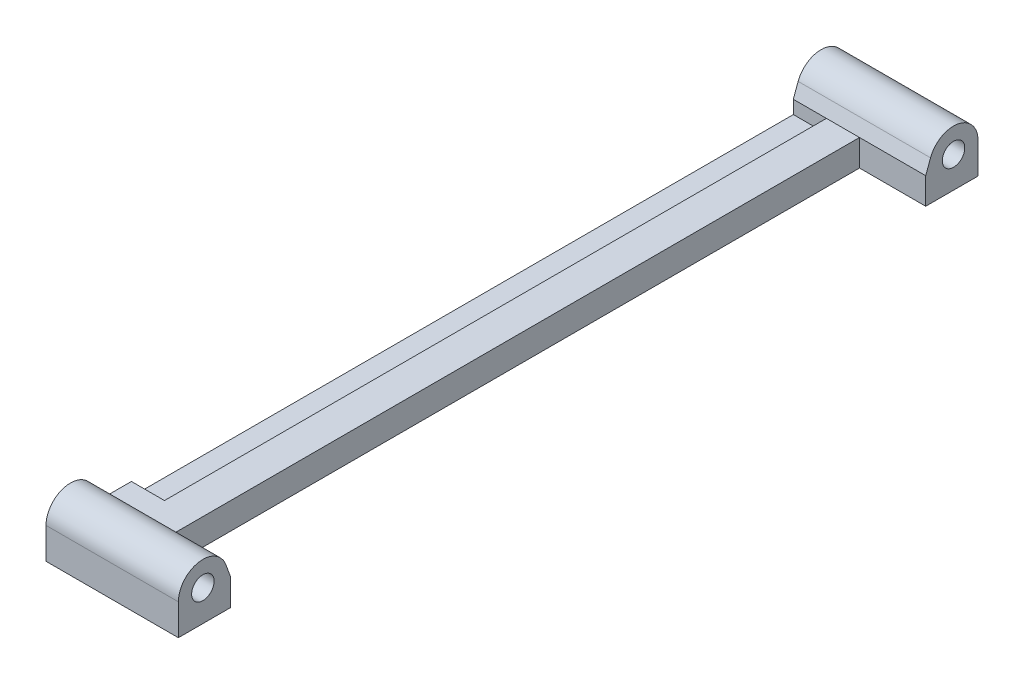
ISO-10303-21;
HEADER;
FILE_DESCRIPTION(('STEP AP214'),'2;1');
FILE_NAME('part.step','',(''),(''),'','','');
FILE_SCHEMA(('AUTOMOTIVE_DESIGN { 1 0 10303 214 1 1 1 1 }'));
ENDSEC;
DATA;
#1=APPLICATION_CONTEXT('core data for automotive mechanical design processes');
#2=APPLICATION_PROTOCOL_DEFINITION('international standard','automotive_design',2000,#1);
#3=PRODUCT_CONTEXT('',#1,'mechanical');
#4=PRODUCT('Part','Part','',(#3));
#5=PRODUCT_RELATED_PRODUCT_CATEGORY('part','',(#4));
#6=PRODUCT_DEFINITION_FORMATION('','',#4);
#7=PRODUCT_DEFINITION_CONTEXT('part definition',#1,'design');
#8=PRODUCT_DEFINITION('design','',#6,#7);
#9=PRODUCT_DEFINITION_SHAPE('','',#8);
#10=(LENGTH_UNIT() NAMED_UNIT(*) SI_UNIT(.MILLI.,.METRE.));
#11=(NAMED_UNIT(*) PLANE_ANGLE_UNIT() SI_UNIT($,.RADIAN.));
#12=(NAMED_UNIT(*) SI_UNIT($,.STERADIAN.) SOLID_ANGLE_UNIT());
#13=UNCERTAINTY_MEASURE_WITH_UNIT(LENGTH_MEASURE(1.E-05),#10,'distance_accuracy_value','');
#14=(GEOMETRIC_REPRESENTATION_CONTEXT(3) GLOBAL_UNCERTAINTY_ASSIGNED_CONTEXT((#13)) GLOBAL_UNIT_ASSIGNED_CONTEXT((#10,
#11,#12)) REPRESENTATION_CONTEXT('',''));
#15=CARTESIAN_POINT('',(0.,0.,0.));
#16=DIRECTION('',(0.,0.,1.));
#17=DIRECTION('',(1.,0.,0.));
#18=AXIS2_PLACEMENT_3D('',#15,#16,#17);
#19=CARTESIAN_POINT('',(10.,0.,100.));
#20=DIRECTION('',(0.,1.,0.));
#21=DIRECTION('',(-1.,0.,0.));
#22=AXIS2_PLACEMENT_3D('',#19,#20,#21);
#23=PLANE('',#22);
#24=DIRECTION('',(0.,0.,-1.));
#25=VECTOR('',#24,1.);
#26=CARTESIAN_POINT('',(0.,0.,100.));
#27=LINE('',#26,#25);
#28=CARTESIAN_POINT('',(0.,0.,112.9));
#29=VERTEX_POINT('',#28);
#30=CARTESIAN_POINT('',(0.,0.,-7.89999999999999));
#31=VERTEX_POINT('',#30);
#32=EDGE_CURVE('E251',#29,#31,#27,.T.);
#33=ORIENTED_EDGE('',*,*,#32,.T.);
#34=DIRECTION('',(-1.,0.,0.));
#35=VECTOR('',#34,1.);
#36=CARTESIAN_POINT('',(20.,0.,-7.89999999999999));
#37=LINE('',#36,#35);
#38=CARTESIAN_POINT('',(20.,0.,-7.89999999999999));
#39=VERTEX_POINT('',#38);
#40=EDGE_CURVE('E182',#39,#31,#37,.T.);
#41=ORIENTED_EDGE('',*,*,#40,.F.);
#42=DIRECTION('',(0.,0.,-1.));
#43=VECTOR('',#42,1.);
#44=CARTESIAN_POINT('',(20.,0.,-7.89999999999999));
#45=LINE('',#44,#43);
#46=CARTESIAN_POINT('',(20.,0.,0.));
#47=VERTEX_POINT('',#46);
#48=EDGE_CURVE('E177',#47,#39,#45,.T.);
#49=ORIENTED_EDGE('',*,*,#48,.F.);
#50=DIRECTION('',(-1.,0.,0.));
#51=VECTOR('',#50,1.);
#52=CARTESIAN_POINT('',(20.,0.,0.));
#53=LINE('',#52,#51);
#54=CARTESIAN_POINT('',(10.,0.,0.));
#55=VERTEX_POINT('',#54);
#56=EDGE_CURVE('E185',#47,#55,#53,.T.);
#57=ORIENTED_EDGE('',*,*,#56,.T.);
#58=DIRECTION('',(0.,0.,-1.));
#59=VECTOR('',#58,1.);
#60=CARTESIAN_POINT('',(10.,0.,100.));
#61=LINE('',#60,#59);
#62=CARTESIAN_POINT('',(10.,0.,105.));
#63=VERTEX_POINT('',#62);
#64=EDGE_CURVE('E11',#63,#55,#61,.T.);
#65=ORIENTED_EDGE('',*,*,#64,.F.);
#66=DIRECTION('',(-1.,0.,0.));
#67=VECTOR('',#66,1.);
#68=CARTESIAN_POINT('',(20.,0.,105.));
#69=LINE('',#68,#67);
#70=CARTESIAN_POINT('',(20.,0.,105.));
#71=VERTEX_POINT('',#70);
#72=EDGE_CURVE('E216',#71,#63,#69,.T.);
#73=ORIENTED_EDGE('',*,*,#72,.F.);
#74=DIRECTION('',(0.,0.,-1.));
#75=VECTOR('',#74,1.);
#76=CARTESIAN_POINT('',(20.,0.,112.9));
#77=LINE('',#76,#75);
#78=CARTESIAN_POINT('',(20.,0.,112.9));
#79=VERTEX_POINT('',#78);
#80=EDGE_CURVE('E214',#79,#71,#77,.T.);
#81=ORIENTED_EDGE('',*,*,#80,.F.);
#82=DIRECTION('',(-1.,0.,0.));
#83=VECTOR('',#82,1.);
#84=CARTESIAN_POINT('',(20.,0.,112.9));
#85=LINE('',#84,#83);
#86=EDGE_CURVE('E219',#79,#29,#85,.T.);
#87=ORIENTED_EDGE('',*,*,#86,.T.);
#88=EDGE_LOOP('',(#33,#41,#49,#57,#65,#73,#81,#87));
#89=FACE_BOUND('',#88,.T.);
#90=ADVANCED_FACE('F33',(#89),#23,.F.);
#91=CARTESIAN_POINT('',(10.,4.,100.));
#92=DIRECTION('',(-1.,0.,0.));
#93=DIRECTION('',(0.,0.,1.));
#94=AXIS2_PLACEMENT_3D('',#91,#92,#93);
#95=PLANE('',#94);
#96=DIRECTION('',(0.,1.,0.));
#97=VECTOR('',#96,1.);
#98=CARTESIAN_POINT('',(10.,4.,0.));
#99=LINE('',#98,#97);
#100=CARTESIAN_POINT('',(10.,4.,0.));
#101=VERTEX_POINT('',#100);
#102=EDGE_CURVE('E243',#55,#101,#99,.T.);
#103=ORIENTED_EDGE('',*,*,#102,.T.);
#104=DIRECTION('',(0.,0.,-1.));
#105=VECTOR('',#104,1.);
#106=CARTESIAN_POINT('',(10.,4.,100.));
#107=LINE('',#106,#105);
#108=CARTESIAN_POINT('',(10.,4.,105.));
#109=VERTEX_POINT('',#108);
#110=EDGE_CURVE('E41',#109,#101,#107,.T.);
#111=ORIENTED_EDGE('',*,*,#110,.F.);
#112=DIRECTION('',(0.,1.,0.));
#113=VECTOR('',#112,1.);
#114=CARTESIAN_POINT('',(10.,0.,105.));
#115=LINE('',#114,#113);
#116=EDGE_CURVE('E230',#63,#109,#115,.T.);
#117=ORIENTED_EDGE('',*,*,#116,.F.);
#118=ORIENTED_EDGE('',*,*,#64,.T.);
#119=EDGE_LOOP('',(#103,#111,#117,#118));
#120=FACE_BOUND('',#119,.T.);
#121=ADVANCED_FACE('F274',(#120),#95,.F.);
#122=CARTESIAN_POINT('',(5.,4.,100.));
#123=DIRECTION('',(0.,-1.,0.));
#124=DIRECTION('',(0.,0.,-1.));
#125=AXIS2_PLACEMENT_3D('',#122,#123,#124);
#126=PLANE('',#125);
#127=DIRECTION('',(-1.,0.,0.));
#128=VECTOR('',#127,1.);
#129=CARTESIAN_POINT('',(5.,4.,0.));
#130=LINE('',#129,#128);
#131=CARTESIAN_POINT('',(5.,4.,0.));
#132=VERTEX_POINT('',#131);
#133=EDGE_CURVE('E254',#101,#132,#130,.T.);
#134=ORIENTED_EDGE('',*,*,#133,.T.);
#135=DIRECTION('',(0.,0.,-1.));
#136=VECTOR('',#135,1.);
#137=CARTESIAN_POINT('',(5.,4.,100.));
#138=LINE('',#137,#136);
#139=CARTESIAN_POINT('',(5.,4.,100.));
#140=VERTEX_POINT('',#139);
#141=EDGE_CURVE('E265',#140,#132,#138,.T.);
#142=ORIENTED_EDGE('',*,*,#141,.F.);
#143=DIRECTION('',(-1.,0.,0.));
#144=VECTOR('',#143,1.);
#145=CARTESIAN_POINT('',(0.,4.,100.));
#146=LINE('',#145,#144);
#147=CARTESIAN_POINT('',(0.,4.,100.));
#148=VERTEX_POINT('',#147);
#149=EDGE_CURVE('E234',#140,#148,#146,.T.);
#150=ORIENTED_EDGE('',*,*,#149,.T.);
#151=DIRECTION('',(0.,0.,-1.));
#152=VECTOR('',#151,1.);
#153=CARTESIAN_POINT('',(0.,4.,105.));
#154=LINE('',#153,#152);
#155=CARTESIAN_POINT('',(0.,4.,105.));
#156=VERTEX_POINT('',#155);
#157=EDGE_CURVE('E237',#156,#148,#154,.T.);
#158=ORIENTED_EDGE('',*,*,#157,.F.);
#159=DIRECTION('',(-1.,0.,0.));
#160=VECTOR('',#159,1.);
#161=CARTESIAN_POINT('',(0.,4.,105.));
#162=LINE('',#161,#160);
#163=EDGE_CURVE('E233',#109,#156,#162,.T.);
#164=ORIENTED_EDGE('',*,*,#163,.F.);
#165=ORIENTED_EDGE('',*,*,#110,.T.);
#166=EDGE_LOOP('',(#134,#142,#150,#158,#164,#165));
#167=FACE_BOUND('',#166,.T.);
#168=ADVANCED_FACE('F270',(#167),#126,.F.);
#169=CARTESIAN_POINT('',(5.,2.,100.));
#170=DIRECTION('',(1.,0.,0.));
#171=DIRECTION('',(0.,0.,-1.));
#172=AXIS2_PLACEMENT_3D('',#169,#170,#171);
#173=PLANE('',#172);
#174=DIRECTION('',(0.,-1.,0.));
#175=VECTOR('',#174,1.);
#176=CARTESIAN_POINT('',(5.,2.,0.));
#177=LINE('',#176,#175);
#178=CARTESIAN_POINT('',(5.,2.,0.));
#179=VERTEX_POINT('',#178);
#180=EDGE_CURVE('E257',#132,#179,#177,.T.);
#181=ORIENTED_EDGE('',*,*,#180,.T.);
#182=DIRECTION('',(0.,0.,-1.));
#183=VECTOR('',#182,1.);
#184=CARTESIAN_POINT('',(5.,2.,100.));
#185=LINE('',#184,#183);
#186=CARTESIAN_POINT('',(5.,2.,100.));
#187=VERTEX_POINT('',#186);
#188=EDGE_CURVE('E48',#187,#179,#185,.T.);
#189=ORIENTED_EDGE('',*,*,#188,.F.);
#190=DIRECTION('',(0.,-1.,0.));
#191=VECTOR('',#190,1.);
#192=CARTESIAN_POINT('',(5.,2.,100.));
#193=LINE('',#192,#191);
#194=EDGE_CURVE('E244',#140,#187,#193,.T.);
#195=ORIENTED_EDGE('',*,*,#194,.F.);
#196=ORIENTED_EDGE('',*,*,#141,.T.);
#197=EDGE_LOOP('',(#181,#189,#195,#196));
#198=FACE_BOUND('',#197,.T.);
#199=ADVANCED_FACE('F300',(#198),#173,.F.);
#200=CARTESIAN_POINT('',(0.,2.,100.));
#201=DIRECTION('',(0.,-1.,0.));
#202=DIRECTION('',(0.,0.,-1.));
#203=AXIS2_PLACEMENT_3D('',#200,#201,#202);
#204=PLANE('',#203);
#205=DIRECTION('',(-1.,0.,0.));
#206=VECTOR('',#205,1.);
#207=CARTESIAN_POINT('',(0.,2.,0.));
#208=LINE('',#207,#206);
#209=CARTESIAN_POINT('',(0.,2.,0.));
#210=VERTEX_POINT('',#209);
#211=EDGE_CURVE('E248',#179,#210,#208,.T.);
#212=ORIENTED_EDGE('',*,*,#211,.T.);
#213=DIRECTION('',(0.,0.,-1.));
#214=VECTOR('',#213,1.);
#215=CARTESIAN_POINT('',(0.,2.,100.));
#216=LINE('',#215,#214);
#217=CARTESIAN_POINT('',(0.,2.,100.));
#218=VERTEX_POINT('',#217);
#219=EDGE_CURVE('E262',#218,#210,#216,.T.);
#220=ORIENTED_EDGE('',*,*,#219,.F.);
#221=DIRECTION('',(-1.,0.,0.));
#222=VECTOR('',#221,1.);
#223=CARTESIAN_POINT('',(0.,2.,100.));
#224=LINE('',#223,#222);
#225=EDGE_CURVE('E247',#187,#218,#224,.T.);
#226=ORIENTED_EDGE('',*,*,#225,.F.);
#227=ORIENTED_EDGE('',*,*,#188,.T.);
#228=EDGE_LOOP('',(#212,#220,#226,#227));
#229=FACE_BOUND('',#228,.T.);
#230=ADVANCED_FACE('F302',(#229),#204,.F.);
#231=CARTESIAN_POINT('',(0.,0.,100.));
#232=DIRECTION('',(1.,0.,0.));
#233=DIRECTION('',(0.,0.,-1.));
#234=AXIS2_PLACEMENT_3D('',#231,#232,#233);
#235=PLANE('',#234);
#236=ORIENTED_EDGE('',*,*,#219,.T.);
#237=DIRECTION('',(0.,-1.,0.));
#238=VECTOR('',#237,1.);
#239=CARTESIAN_POINT('',(0.,4.,0.));
#240=LINE('',#239,#238);
#241=CARTESIAN_POINT('',(0.,4.,0.));
#242=VERTEX_POINT('',#241);
#243=EDGE_CURVE('E156',#242,#210,#240,.T.);
#244=ORIENTED_EDGE('',*,*,#243,.F.);
#245=DIRECTION('',(0.,-0.938499256778787,0.345281254958424));
#246=VECTOR('',#245,1.);
#247=CARTESIAN_POINT('',(0.,5.97754064334618,-0.727552749918481));
#248=LINE('',#247,#246);
#249=CARTESIAN_POINT('',(0.,5.97754064334618,-0.727552749918481));
#250=VERTEX_POINT('',#249);
#251=EDGE_CURVE('E137',#250,#242,#248,.T.);
#252=ORIENTED_EDGE('',*,*,#251,.F.);
#253=CARTESIAN_POINT('',(0.,4.7,-4.2));
#254=DIRECTION('',(1.,0.,0.));
#255=DIRECTION('',(0.,0.,-1.));
#256=AXIS2_PLACEMENT_3D('',#253,#254,#255);
#257=CIRCLE('',#256,3.7);
#258=CARTESIAN_POINT('',(0.,4.7,-7.89999999999999));
#259=VERTEX_POINT('',#258);
#260=EDGE_CURVE('E154',#259,#250,#257,.T.);
#261=ORIENTED_EDGE('',*,*,#260,.F.);
#262=DIRECTION('',(0.,1.,0.));
#263=VECTOR('',#262,1.);
#264=CARTESIAN_POINT('',(0.,4.7,-7.89999999999999));
#265=LINE('',#264,#263);
#266=EDGE_CURVE('E167',#31,#259,#265,.T.);
#267=ORIENTED_EDGE('',*,*,#266,.F.);
#268=ORIENTED_EDGE('',*,*,#32,.F.);
#269=DIRECTION('',(0.,-1.,0.));
#270=VECTOR('',#269,1.);
#271=CARTESIAN_POINT('',(0.,4.7,112.9));
#272=LINE('',#271,#270);
#273=CARTESIAN_POINT('',(0.,4.7,112.9));
#274=VERTEX_POINT('',#273);
#275=EDGE_CURVE('E199',#274,#29,#272,.T.);
#276=ORIENTED_EDGE('',*,*,#275,.F.);
#277=CARTESIAN_POINT('',(0.,4.7,109.2));
#278=DIRECTION('',(1.,0.,0.));
#279=DIRECTION('',(0.,0.,1.));
#280=AXIS2_PLACEMENT_3D('',#277,#278,#279);
#281=CIRCLE('',#280,3.7);
#282=CARTESIAN_POINT('',(0.,5.97754064334618,105.727552749918));
#283=VERTEX_POINT('',#282);
#284=EDGE_CURVE('E196',#283,#274,#281,.T.);
#285=ORIENTED_EDGE('',*,*,#284,.F.);
#286=DIRECTION('',(0.,0.938499256778787,0.345281254958424));
#287=VECTOR('',#286,1.);
#288=CARTESIAN_POINT('',(0.,5.97754064334618,105.727552749918));
#289=LINE('',#288,#287);
#290=EDGE_CURVE('E193',#156,#283,#289,.T.);
#291=ORIENTED_EDGE('',*,*,#290,.F.);
#292=ORIENTED_EDGE('',*,*,#157,.T.);
#293=DIRECTION('',(0.,-1.,0.));
#294=VECTOR('',#293,1.);
#295=CARTESIAN_POINT('',(0.,0.,100.));
#296=LINE('',#295,#294);
#297=EDGE_CURVE('E229',#148,#218,#296,.T.);
#298=ORIENTED_EDGE('',*,*,#297,.T.);
#299=EDGE_LOOP('',(#236,#244,#252,#261,#267,#268,#276,#285,#291,#292,#298));
#300=FACE_BOUND('',#299,.T.);
#301=CARTESIAN_POINT('',(0.,4.7,109.2));
#302=DIRECTION('',(1.,0.,0.));
#303=DIRECTION('',(0.,0.,-1.));
#304=AXIS2_PLACEMENT_3D('',#301,#302,#303);
#305=CIRCLE('',#304,1.7);
#306=CARTESIAN_POINT('',(0.,4.7,107.5));
#307=VERTEX_POINT('',#306);
#308=EDGE_CURVE('E144',#307,#307,#305,.T.);
#309=ORIENTED_EDGE('',*,*,#308,.T.);
#310=EDGE_LOOP('',(#309));
#311=FACE_BOUND('',#310,.T.);
#312=CARTESIAN_POINT('',(0.,4.7,-4.2));
#313=DIRECTION('',(1.,0.,0.));
#314=DIRECTION('',(0.,0.,1.));
#315=AXIS2_PLACEMENT_3D('',#312,#313,#314);
#316=CIRCLE('',#315,1.7);
#317=CARTESIAN_POINT('',(0.,4.7,-2.5));
#318=VERTEX_POINT('',#317);
#319=EDGE_CURVE('E161',#318,#318,#316,.T.);
#320=ORIENTED_EDGE('',*,*,#319,.T.);
#321=EDGE_LOOP('',(#320));
#322=FACE_BOUND('',#321,.T.);
#323=ADVANCED_FACE('F151',(#300,#311,#322),#235,.F.);
#324=CARTESIAN_POINT('',(0.,0.,100.));
#325=DIRECTION('',(0.,0.,-1.));
#326=DIRECTION('',(-1.,0.,0.));
#327=AXIS2_PLACEMENT_3D('',#324,#325,#326);
#328=PLANE('',#327);
#329=ORIENTED_EDGE('',*,*,#149,.F.);
#330=ORIENTED_EDGE('',*,*,#194,.T.);
#331=ORIENTED_EDGE('',*,*,#225,.T.);
#332=ORIENTED_EDGE('',*,*,#297,.F.);
#333=EDGE_LOOP('',(#329,#330,#331,#332));
#334=FACE_BOUND('',#333,.T.);
#335=ADVANCED_FACE('F306',(#334),#328,.T.);
#336=CARTESIAN_POINT('',(20.,4.,105.));
#337=DIRECTION('',(0.,0.,1.));
#338=DIRECTION('',(1.,0.,0.));
#339=AXIS2_PLACEMENT_3D('',#336,#337,#338);
#340=PLANE('',#339);
#341=ORIENTED_EDGE('',*,*,#72,.T.);
#342=ORIENTED_EDGE('',*,*,#116,.T.);
#343=DIRECTION('',(-1.,0.,0.));
#344=VECTOR('',#343,1.);
#345=CARTESIAN_POINT('',(20.,4.,105.));
#346=LINE('',#345,#344);
#347=CARTESIAN_POINT('',(20.,4.,105.));
#348=VERTEX_POINT('',#347);
#349=EDGE_CURVE('E226',#348,#109,#346,.T.);
#350=ORIENTED_EDGE('',*,*,#349,.F.);
#351=DIRECTION('',(0.,1.,0.));
#352=VECTOR('',#351,1.);
#353=CARTESIAN_POINT('',(20.,4.,105.));
#354=LINE('',#353,#352);
#355=EDGE_CURVE('E205',#71,#348,#354,.T.);
#356=ORIENTED_EDGE('',*,*,#355,.F.);
#357=EDGE_LOOP('',(#341,#342,#350,#356));
#358=FACE_BOUND('',#357,.T.);
#359=ADVANCED_FACE('F277',(#358),#340,.F.);
#360=CARTESIAN_POINT('',(20.,4.7,109.2));
#361=DIRECTION('',(-1.,0.,0.));
#362=DIRECTION('',(0.,0.,1.));
#363=AXIS2_PLACEMENT_3D('',#360,#361,#362);
#364=PLANE('',#363);
#365=ORIENTED_EDGE('',*,*,#355,.T.);
#366=DIRECTION('',(0.,0.938499256778787,0.345281254958424));
#367=VECTOR('',#366,1.);
#368=CARTESIAN_POINT('',(20.,5.97754064334618,105.727552749918));
#369=LINE('',#368,#367);
#370=CARTESIAN_POINT('',(20.,5.97754064334618,105.727552749918));
#371=VERTEX_POINT('',#370);
#372=EDGE_CURVE('E208',#348,#371,#369,.T.);
#373=ORIENTED_EDGE('',*,*,#372,.T.);
#374=CARTESIAN_POINT('',(20.,4.7,109.2));
#375=DIRECTION('',(1.,0.,0.));
#376=DIRECTION('',(0.,0.,1.));
#377=AXIS2_PLACEMENT_3D('',#374,#375,#376);
#378=CIRCLE('',#377,3.7);
#379=CARTESIAN_POINT('',(20.,4.7,112.9));
#380=VERTEX_POINT('',#379);
#381=EDGE_CURVE('E210',#371,#380,#378,.T.);
#382=ORIENTED_EDGE('',*,*,#381,.T.);
#383=DIRECTION('',(0.,-1.,0.));
#384=VECTOR('',#383,1.);
#385=CARTESIAN_POINT('',(20.,4.7,112.9));
#386=LINE('',#385,#384);
#387=EDGE_CURVE('E212',#380,#79,#386,.T.);
#388=ORIENTED_EDGE('',*,*,#387,.T.);
#389=ORIENTED_EDGE('',*,*,#80,.T.);
#390=EDGE_LOOP('',(#365,#373,#382,#388,#389));
#391=FACE_BOUND('',#390,.T.);
#392=CARTESIAN_POINT('',(20.,4.7,109.2));
#393=DIRECTION('',(1.,0.,0.));
#394=DIRECTION('',(0.,0.,-1.));
#395=AXIS2_PLACEMENT_3D('',#392,#393,#394);
#396=CIRCLE('',#395,1.7);
#397=CARTESIAN_POINT('',(20.,4.7,107.5));
#398=VERTEX_POINT('',#397);
#399=EDGE_CURVE('E202',#398,#398,#396,.T.);
#400=ORIENTED_EDGE('',*,*,#399,.F.);
#401=EDGE_LOOP('',(#400));
#402=FACE_BOUND('',#401,.T.);
#403=ADVANCED_FACE('F286',(#391,#402),#364,.F.);
#404=CARTESIAN_POINT('',(20.,5.97754064334618,105.727552749918));
#405=DIRECTION('',(0.,-0.345281254958424,0.938499256778787));
#406=DIRECTION('',(0.,-0.938499256778787,-0.345281254958424));
#407=AXIS2_PLACEMENT_3D('',#404,#405,#406);
#408=PLANE('',#407);
#409=ORIENTED_EDGE('',*,*,#349,.T.);
#410=ORIENTED_EDGE('',*,*,#163,.T.);
#411=ORIENTED_EDGE('',*,*,#290,.T.);
#412=DIRECTION('',(-1.,0.,0.));
#413=VECTOR('',#412,1.);
#414=CARTESIAN_POINT('',(20.,5.97754064334618,105.727552749918));
#415=LINE('',#414,#413);
#416=EDGE_CURVE('E224',#371,#283,#415,.T.);
#417=ORIENTED_EDGE('',*,*,#416,.F.);
#418=ORIENTED_EDGE('',*,*,#372,.F.);
#419=EDGE_LOOP('',(#409,#410,#411,#417,#418));
#420=FACE_BOUND('',#419,.T.);
#421=ADVANCED_FACE('F281',(#420),#408,.F.);
#422=CARTESIAN_POINT('',(20.,4.7,109.2));
#423=DIRECTION('',(-1.,0.,0.));
#424=DIRECTION('',(0.,0.,1.));
#425=AXIS2_PLACEMENT_3D('',#422,#423,#424);
#426=CYLINDRICAL_SURFACE('',#425,3.7);
#427=ORIENTED_EDGE('',*,*,#416,.T.);
#428=ORIENTED_EDGE('',*,*,#284,.T.);
#429=DIRECTION('',(-1.,0.,0.));
#430=VECTOR('',#429,1.);
#431=CARTESIAN_POINT('',(20.,4.7,112.9));
#432=LINE('',#431,#430);
#433=EDGE_CURVE('E222',#380,#274,#432,.T.);
#434=ORIENTED_EDGE('',*,*,#433,.F.);
#435=ORIENTED_EDGE('',*,*,#381,.F.);
#436=EDGE_LOOP('',(#427,#428,#434,#435));
#437=FACE_BOUND('',#436,.T.);
#438=ADVANCED_FACE('F311',(#437),#426,.T.);
#439=CARTESIAN_POINT('',(20.,4.7,112.9));
#440=DIRECTION('',(0.,0.,-1.));
#441=DIRECTION('',(-1.,0.,0.));
#442=AXIS2_PLACEMENT_3D('',#439,#440,#441);
#443=PLANE('',#442);
#444=ORIENTED_EDGE('',*,*,#433,.T.);
#445=ORIENTED_EDGE('',*,*,#275,.T.);
#446=ORIENTED_EDGE('',*,*,#86,.F.);
#447=ORIENTED_EDGE('',*,*,#387,.F.);
#448=EDGE_LOOP('',(#444,#445,#446,#447));
#449=FACE_BOUND('',#448,.T.);
#450=ADVANCED_FACE('F313',(#449),#443,.F.);
#451=CARTESIAN_POINT('',(20.,4.7,109.2));
#452=DIRECTION('',(-1.,0.,0.));
#453=DIRECTION('',(0.,0.,1.));
#454=AXIS2_PLACEMENT_3D('',#451,#452,#453);
#455=CYLINDRICAL_SURFACE('',#454,1.7);
#456=ORIENTED_EDGE('',*,*,#399,.T.);
#457=EDGE_LOOP('',(#456));
#458=FACE_BOUND('',#457,.T.);
#459=ORIENTED_EDGE('',*,*,#308,.F.);
#460=EDGE_LOOP('',(#459));
#461=FACE_BOUND('',#460,.T.);
#462=ADVANCED_FACE('F403',(#458,#461),#455,.F.);
#463=CARTESIAN_POINT('',(20.,4.,0.));
#464=DIRECTION('',(0.,0.,-1.));
#465=DIRECTION('',(-1.,0.,0.));
#466=AXIS2_PLACEMENT_3D('',#463,#464,#465);
#467=PLANE('',#466);
#468=ORIENTED_EDGE('',*,*,#211,.F.);
#469=ORIENTED_EDGE('',*,*,#180,.F.);
#470=DIRECTION('',(-1.,0.,0.));
#471=VECTOR('',#470,1.);
#472=CARTESIAN_POINT('',(20.,4.,0.));
#473=LINE('',#472,#471);
#474=EDGE_CURVE('E188',#132,#242,#473,.T.);
#475=ORIENTED_EDGE('',*,*,#474,.T.);
#476=ORIENTED_EDGE('',*,*,#243,.T.);
#477=EDGE_LOOP('',(#468,#469,#475,#476));
#478=FACE_BOUND('',#477,.T.);
#479=ADVANCED_FACE('F299',(#478),#467,.F.);
#480=CARTESIAN_POINT('',(20.,4.7,-4.2));
#481=DIRECTION('',(1.,0.,0.));
#482=DIRECTION('',(0.,0.,-1.));
#483=AXIS2_PLACEMENT_3D('',#480,#481,#482);
#484=PLANE('',#483);
#485=CARTESIAN_POINT('',(20.,4.7,-4.2));
#486=DIRECTION('',(1.,0.,0.));
#487=DIRECTION('',(0.,0.,-1.));
#488=AXIS2_PLACEMENT_3D('',#485,#486,#487);
#489=CIRCLE('',#488,3.7);
#490=CARTESIAN_POINT('',(20.,4.7,-7.89999999999999));
#491=VERTEX_POINT('',#490);
#492=CARTESIAN_POINT('',(20.,5.97754064334618,-0.727552749918481));
#493=VERTEX_POINT('',#492);
#494=EDGE_CURVE('E172',#491,#493,#489,.T.);
#495=ORIENTED_EDGE('',*,*,#494,.T.);
#496=DIRECTION('',(0.,-0.938499256778787,0.345281254958424));
#497=VECTOR('',#496,1.);
#498=CARTESIAN_POINT('',(20.,5.97754064334618,-0.727552749918481));
#499=LINE('',#498,#497);
#500=CARTESIAN_POINT('',(20.,4.,0.));
#501=VERTEX_POINT('',#500);
#502=EDGE_CURVE('E139',#493,#501,#499,.T.);
#503=ORIENTED_EDGE('',*,*,#502,.T.);
#504=DIRECTION('',(0.,-1.,0.));
#505=VECTOR('',#504,1.);
#506=CARTESIAN_POINT('',(20.,4.,0.));
#507=LINE('',#506,#505);
#508=EDGE_CURVE('E175',#501,#47,#507,.T.);
#509=ORIENTED_EDGE('',*,*,#508,.T.);
#510=ORIENTED_EDGE('',*,*,#48,.T.);
#511=DIRECTION('',(0.,1.,0.));
#512=VECTOR('',#511,1.);
#513=CARTESIAN_POINT('',(20.,4.7,-7.89999999999999));
#514=LINE('',#513,#512);
#515=EDGE_CURVE('E179',#39,#491,#514,.T.);
#516=ORIENTED_EDGE('',*,*,#515,.T.);
#517=EDGE_LOOP('',(#495,#503,#509,#510,#516));
#518=FACE_BOUND('',#517,.T.);
#519=CARTESIAN_POINT('',(20.,4.7,-4.2));
#520=DIRECTION('',(1.,0.,0.));
#521=DIRECTION('',(0.,0.,1.));
#522=AXIS2_PLACEMENT_3D('',#519,#520,#521);
#523=CIRCLE('',#522,1.7);
#524=CARTESIAN_POINT('',(20.,4.7,-2.5));
#525=VERTEX_POINT('',#524);
#526=EDGE_CURVE('E169',#525,#525,#523,.T.);
#527=ORIENTED_EDGE('',*,*,#526,.F.);
#528=EDGE_LOOP('',(#527));
#529=FACE_BOUND('',#528,.T.);
#530=ADVANCED_FACE('F318',(#518,#529),#484,.T.);
#531=CARTESIAN_POINT('',(20.,4.7,-4.2));
#532=DIRECTION('',(-1.,0.,0.));
#533=DIRECTION('',(0.,0.,1.));
#534=AXIS2_PLACEMENT_3D('',#531,#532,#533);
#535=CYLINDRICAL_SURFACE('',#534,3.7);
#536=DIRECTION('',(-1.,0.,0.));
#537=VECTOR('',#536,1.);
#538=CARTESIAN_POINT('',(20.,4.7,-7.89999999999999));
#539=LINE('',#538,#537);
#540=EDGE_CURVE('E160',#491,#259,#539,.T.);
#541=ORIENTED_EDGE('',*,*,#540,.T.);
#542=ORIENTED_EDGE('',*,*,#260,.T.);
#543=DIRECTION('',(-1.,0.,0.));
#544=VECTOR('',#543,1.);
#545=CARTESIAN_POINT('',(20.,5.97754064334618,-0.727552749918481));
#546=LINE('',#545,#544);
#547=EDGE_CURVE('E133',#493,#250,#546,.T.);
#548=ORIENTED_EDGE('',*,*,#547,.F.);
#549=ORIENTED_EDGE('',*,*,#494,.F.);
#550=EDGE_LOOP('',(#541,#542,#548,#549));
#551=FACE_BOUND('',#550,.T.);
#552=ADVANCED_FACE('F158',(#551),#535,.T.);
#553=CARTESIAN_POINT('',(20.,5.97754064334618,-0.727552749918481));
#554=DIRECTION('',(0.,-0.345281254958424,-0.938499256778787));
#555=DIRECTION('',(0.,0.938499256778787,-0.345281254958424));
#556=AXIS2_PLACEMENT_3D('',#553,#554,#555);
#557=PLANE('',#556);
#558=ORIENTED_EDGE('',*,*,#547,.T.);
#559=ORIENTED_EDGE('',*,*,#251,.T.);
#560=ORIENTED_EDGE('',*,*,#474,.F.);
#561=ORIENTED_EDGE('',*,*,#133,.F.);
#562=EDGE_CURVE('E145',#501,#101,#473,.T.);
#563=ORIENTED_EDGE('',*,*,#562,.F.);
#564=ORIENTED_EDGE('',*,*,#502,.F.);
#565=EDGE_LOOP('',(#558,#559,#560,#561,#563,#564));
#566=FACE_BOUND('',#565,.T.);
#567=ADVANCED_FACE('F135',(#566),#557,.F.);
#568=ORIENTED_EDGE('',*,*,#102,.F.);
#569=ORIENTED_EDGE('',*,*,#56,.F.);
#570=ORIENTED_EDGE('',*,*,#508,.F.);
#571=ORIENTED_EDGE('',*,*,#562,.T.);
#572=EDGE_LOOP('',(#568,#569,#570,#571));
#573=FACE_BOUND('',#572,.T.);
#574=ADVANCED_FACE('F297',(#573),#467,.F.);
#575=CARTESIAN_POINT('',(20.,4.7,-7.89999999999999));
#576=DIRECTION('',(0.,0.,1.));
#577=DIRECTION('',(1.,0.,0.));
#578=AXIS2_PLACEMENT_3D('',#575,#576,#577);
#579=PLANE('',#578);
#580=ORIENTED_EDGE('',*,*,#40,.T.);
#581=ORIENTED_EDGE('',*,*,#266,.T.);
#582=ORIENTED_EDGE('',*,*,#540,.F.);
#583=ORIENTED_EDGE('',*,*,#515,.F.);
#584=EDGE_LOOP('',(#580,#581,#582,#583));
#585=FACE_BOUND('',#584,.T.);
#586=ADVANCED_FACE('F316',(#585),#579,.F.);
#587=CARTESIAN_POINT('',(20.,4.7,-4.2));
#588=DIRECTION('',(-1.,0.,0.));
#589=DIRECTION('',(0.,0.,1.));
#590=AXIS2_PLACEMENT_3D('',#587,#588,#589);
#591=CYLINDRICAL_SURFACE('',#590,1.7);
#592=ORIENTED_EDGE('',*,*,#526,.T.);
#593=EDGE_LOOP('',(#592));
#594=FACE_BOUND('',#593,.T.);
#595=ORIENTED_EDGE('',*,*,#319,.F.);
#596=EDGE_LOOP('',(#595));
#597=FACE_BOUND('',#596,.T.);
#598=ADVANCED_FACE('F324',(#594,#597),#591,.F.);
#599=CLOSED_SHELL('',(#90,#121,#168,#199,#230,#323,#335,#359,#403,#421,#438,#450,#462,#479,#530,
#552,#567,#574,#586,#598));
#600=MANIFOLD_SOLID_BREP('B2',#599);
#601=ADVANCED_BREP_SHAPE_REPRESENTATION('',(#18,#600),#14);
#602=SHAPE_DEFINITION_REPRESENTATION(#9,#601);
ENDSEC;
END-ISO-10303-21;
